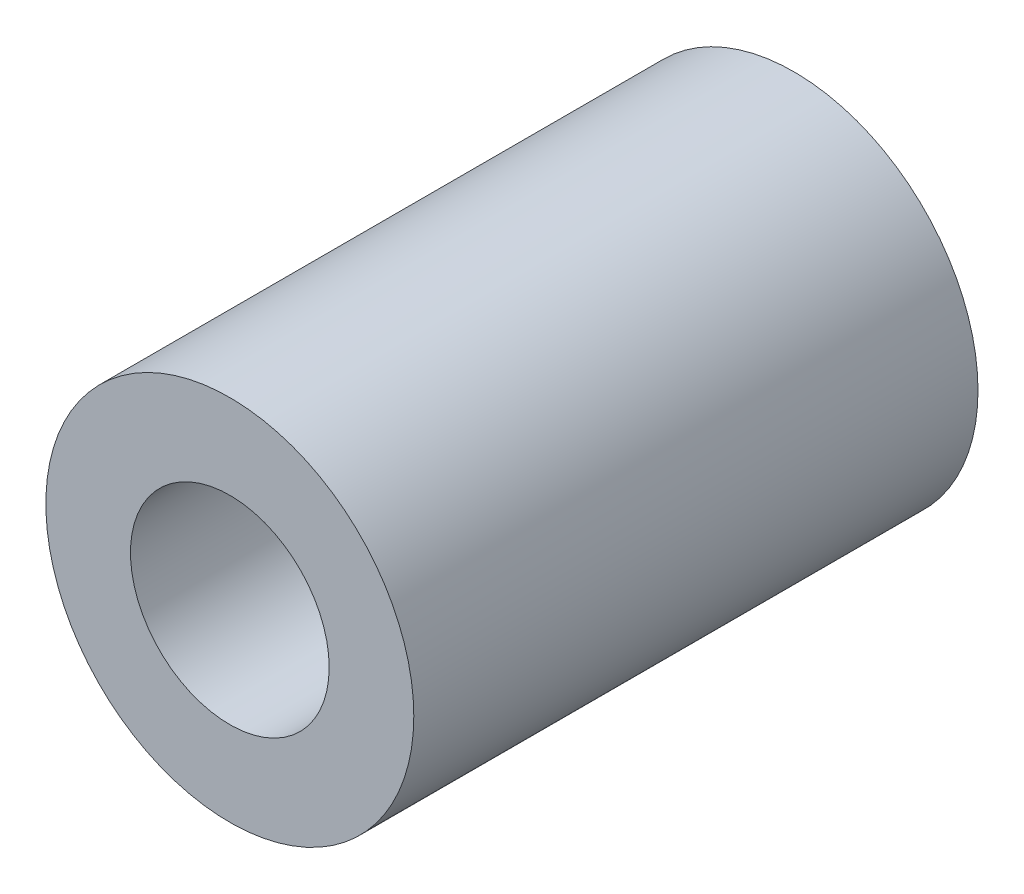
ISO-10303-21;
HEADER;
FILE_DESCRIPTION(('STEP AP214'),'2;1');
FILE_NAME('part.step','',(''),(''),'','','');
FILE_SCHEMA(('AUTOMOTIVE_DESIGN { 1 0 10303 214 1 1 1 1 }'));
ENDSEC;
DATA;
#1=APPLICATION_CONTEXT('core data for automotive mechanical design processes');
#2=APPLICATION_PROTOCOL_DEFINITION('international standard','automotive_design',2000,#1);
#3=PRODUCT_CONTEXT('',#1,'mechanical');
#4=PRODUCT('Part','Part','',(#3));
#5=PRODUCT_RELATED_PRODUCT_CATEGORY('part','',(#4));
#6=PRODUCT_DEFINITION_FORMATION('','',#4);
#7=PRODUCT_DEFINITION_CONTEXT('part definition',#1,'design');
#8=PRODUCT_DEFINITION('design','',#6,#7);
#9=PRODUCT_DEFINITION_SHAPE('','',#8);
#10=(LENGTH_UNIT() NAMED_UNIT(*) SI_UNIT(.MILLI.,.METRE.));
#11=(NAMED_UNIT(*) PLANE_ANGLE_UNIT() SI_UNIT($,.RADIAN.));
#12=(NAMED_UNIT(*) SI_UNIT($,.STERADIAN.) SOLID_ANGLE_UNIT());
#13=UNCERTAINTY_MEASURE_WITH_UNIT(LENGTH_MEASURE(1.E-05),#10,'distance_accuracy_value','');
#14=(GEOMETRIC_REPRESENTATION_CONTEXT(3) GLOBAL_UNCERTAINTY_ASSIGNED_CONTEXT((#13)) GLOBAL_UNIT_ASSIGNED_CONTEXT((#10,
#11,#12)) REPRESENTATION_CONTEXT('',''));
#15=CARTESIAN_POINT('',(0.,0.,0.));
#16=DIRECTION('',(0.,0.,1.));
#17=DIRECTION('',(1.,0.,0.));
#18=AXIS2_PLACEMENT_3D('',#15,#16,#17);
#19=CARTESIAN_POINT('',(0.,0.,23.));
#20=DIRECTION('',(0.,0.,-0.999999999999999));
#21=DIRECTION('',(-1.,0.,0.));
#22=AXIS2_PLACEMENT_3D('',#19,#20,#21);
#23=CYLINDRICAL_SURFACE('',#22,7.5);
#24=CARTESIAN_POINT('',(0.,0.,23.));
#25=DIRECTION('',(0.,0.,0.999999999999999));
#26=DIRECTION('',(1.,0.,0.));
#27=AXIS2_PLACEMENT_3D('',#24,#25,#26);
#28=CIRCLE('',#27,7.5);
#29=CARTESIAN_POINT('',(7.5,0.,23.));
#30=VERTEX_POINT('',#29);
#31=EDGE_CURVE('E12',#30,#30,#28,.T.);
#32=ORIENTED_EDGE('',*,*,#31,.F.);
#33=EDGE_LOOP('',(#32));
#34=FACE_BOUND('',#33,.T.);
#35=CARTESIAN_POINT('',(0.,0.,0.));
#36=DIRECTION('',(0.,0.,0.999999999999999));
#37=DIRECTION('',(1.,0.,0.));
#38=AXIS2_PLACEMENT_3D('',#35,#36,#37);
#39=CIRCLE('',#38,7.5);
#40=CARTESIAN_POINT('',(7.5,0.,0.));
#41=VERTEX_POINT('',#40);
#42=EDGE_CURVE('E51',#41,#41,#39,.T.);
#43=ORIENTED_EDGE('',*,*,#42,.T.);
#44=EDGE_LOOP('',(#43));
#45=FACE_BOUND('',#44,.T.);
#46=ADVANCED_FACE('F48',(#34,#45),#23,.T.);
#47=CARTESIAN_POINT('',(0.,0.,23.));
#48=DIRECTION('',(0.,0.,0.999999999999999));
#49=DIRECTION('',(1.,0.,0.));
#50=AXIS2_PLACEMENT_3D('',#47,#48,#49);
#51=PLANE('',#50);
#52=CARTESIAN_POINT('',(0.,0.,23.));
#53=DIRECTION('',(0.,0.,0.999999999999999));
#54=DIRECTION('',(1.,0.,0.));
#55=AXIS2_PLACEMENT_3D('',#52,#53,#54);
#56=CIRCLE('',#55,4.05);
#57=CARTESIAN_POINT('',(4.05,0.,23.));
#58=VERTEX_POINT('',#57);
#59=EDGE_CURVE('E60',#58,#58,#56,.T.);
#60=ORIENTED_EDGE('',*,*,#59,.F.);
#61=EDGE_LOOP('',(#60));
#62=FACE_BOUND('',#61,.T.);
#63=ORIENTED_EDGE('',*,*,#31,.T.);
#64=EDGE_LOOP('',(#63));
#65=FACE_BOUND('',#64,.T.);
#66=ADVANCED_FACE('F75',(#62,#65),#51,.T.);
#67=CARTESIAN_POINT('',(0.,0.,0.));
#68=DIRECTION('',(0.,0.,0.999999999999999));
#69=DIRECTION('',(1.,0.,0.));
#70=AXIS2_PLACEMENT_3D('',#67,#68,#69);
#71=PLANE('',#70);
#72=CARTESIAN_POINT('',(0.,0.,0.));
#73=DIRECTION('',(0.,0.,0.999999999999999));
#74=DIRECTION('',(1.,0.,0.));
#75=AXIS2_PLACEMENT_3D('',#72,#73,#74);
#76=CIRCLE('',#75,4.05);
#77=CARTESIAN_POINT('',(4.05,0.,0.));
#78=VERTEX_POINT('',#77);
#79=EDGE_CURVE('E58',#78,#78,#76,.T.);
#80=ORIENTED_EDGE('',*,*,#79,.T.);
#81=EDGE_LOOP('',(#80));
#82=FACE_BOUND('',#81,.T.);
#83=ORIENTED_EDGE('',*,*,#42,.F.);
#84=EDGE_LOOP('',(#83));
#85=FACE_BOUND('',#84,.T.);
#86=ADVANCED_FACE('F66',(#82,#85),#71,.F.);
#87=CARTESIAN_POINT('',(0.,0.,0.));
#88=DIRECTION('',(0.,0.,0.999999999999999));
#89=DIRECTION('',(1.,0.,0.));
#90=AXIS2_PLACEMENT_3D('',#87,#88,#89);
#91=CYLINDRICAL_SURFACE('',#90,4.05);
#92=ORIENTED_EDGE('',*,*,#79,.F.);
#93=EDGE_LOOP('',(#92));
#94=FACE_BOUND('',#93,.T.);
#95=ORIENTED_EDGE('',*,*,#59,.T.);
#96=EDGE_LOOP('',(#95));
#97=FACE_BOUND('',#96,.T.);
#98=ADVANCED_FACE('F69',(#94,#97),#91,.F.);
#99=CLOSED_SHELL('',(#46,#66,#86,#98));
#100=MANIFOLD_SOLID_BREP('B2',#99);
#101=ADVANCED_BREP_SHAPE_REPRESENTATION('',(#18,#100),#14);
#102=SHAPE_DEFINITION_REPRESENTATION(#9,#101);
ENDSEC;
END-ISO-10303-21;
